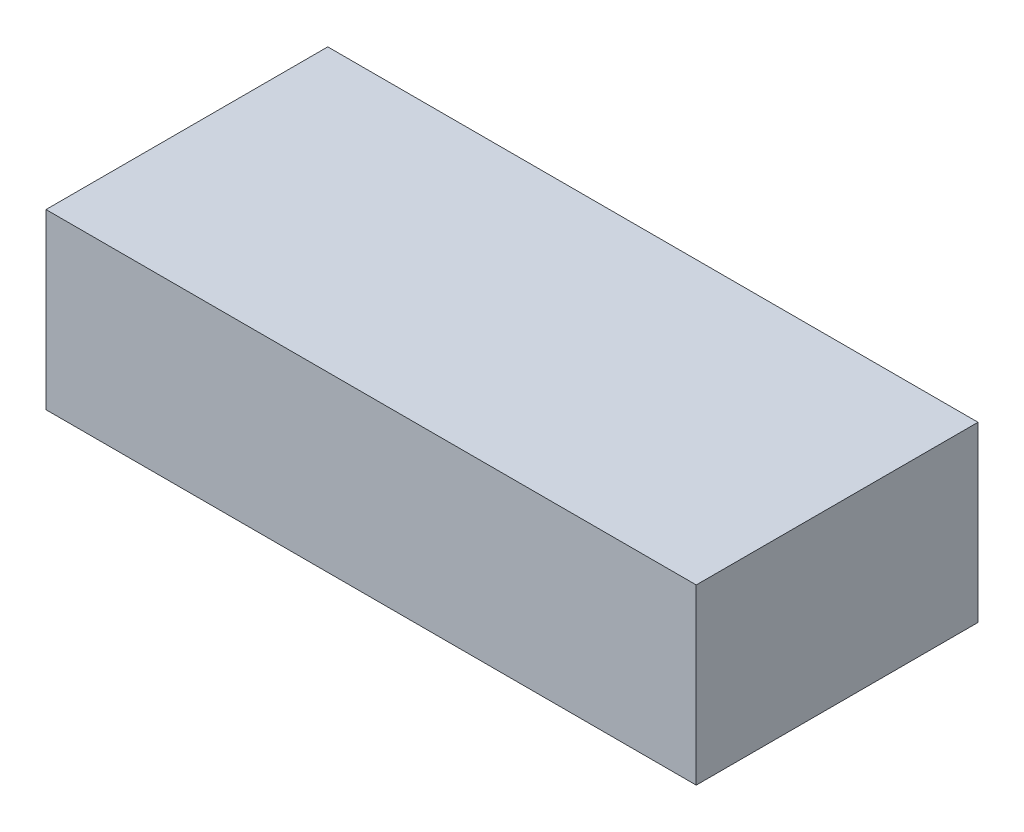
ISO-10303-21;
HEADER;
FILE_DESCRIPTION(('STEP AP214'),'2;1');
FILE_NAME('part.step','',(''),(''),'','','');
FILE_SCHEMA(('AUTOMOTIVE_DESIGN { 1 0 10303 214 1 1 1 1 }'));
ENDSEC;
DATA;
#1=APPLICATION_CONTEXT('core data for automotive mechanical design processes');
#2=APPLICATION_PROTOCOL_DEFINITION('international standard','automotive_design',2000,#1);
#3=PRODUCT_CONTEXT('',#1,'mechanical');
#4=PRODUCT('Part','Part','',(#3));
#5=PRODUCT_RELATED_PRODUCT_CATEGORY('part','',(#4));
#6=PRODUCT_DEFINITION_FORMATION('','',#4);
#7=PRODUCT_DEFINITION_CONTEXT('part definition',#1,'design');
#8=PRODUCT_DEFINITION('design','',#6,#7);
#9=PRODUCT_DEFINITION_SHAPE('','',#8);
#10=(LENGTH_UNIT() NAMED_UNIT(*) SI_UNIT(.MILLI.,.METRE.));
#11=(NAMED_UNIT(*) PLANE_ANGLE_UNIT() SI_UNIT($,.RADIAN.));
#12=(NAMED_UNIT(*) SI_UNIT($,.STERADIAN.) SOLID_ANGLE_UNIT());
#13=UNCERTAINTY_MEASURE_WITH_UNIT(LENGTH_MEASURE(1.E-05),#10,'distance_accuracy_value','');
#14=(GEOMETRIC_REPRESENTATION_CONTEXT(3) GLOBAL_UNCERTAINTY_ASSIGNED_CONTEXT((#13)) GLOBAL_UNIT_ASSIGNED_CONTEXT((#10,
#11,#12)) REPRESENTATION_CONTEXT('',''));
#15=CARTESIAN_POINT('',(0.,0.,0.));
#16=DIRECTION('',(0.,0.,1.));
#17=DIRECTION('',(1.,0.,0.));
#18=AXIS2_PLACEMENT_3D('',#15,#16,#17);
#19=CARTESIAN_POINT('',(75.,40.,32.5));
#20=DIRECTION('',(-1.,0.,0.));
#21=DIRECTION('',(0.,0.,1.));
#22=AXIS2_PLACEMENT_3D('',#19,#20,#21);
#23=PLANE('',#22);
#24=DIRECTION('',(0.,0.,-1.));
#25=VECTOR('',#24,1.);
#26=CARTESIAN_POINT('',(75.,0.,32.5));
#27=LINE('',#26,#25);
#28=CARTESIAN_POINT('',(75.,0.,32.5));
#29=VERTEX_POINT('',#28);
#30=CARTESIAN_POINT('',(75.,0.,-32.5));
#31=VERTEX_POINT('',#30);
#32=EDGE_CURVE('E164',#29,#31,#27,.T.);
#33=ORIENTED_EDGE('',*,*,#32,.T.);
#34=DIRECTION('',(0.,-1.,0.));
#35=VECTOR('',#34,1.);
#36=CARTESIAN_POINT('',(75.,40.,-32.5));
#37=LINE('',#36,#35);
#38=CARTESIAN_POINT('',(75.,40.,-32.5));
#39=VERTEX_POINT('',#38);
#40=EDGE_CURVE('E11',#39,#31,#37,.T.);
#41=ORIENTED_EDGE('',*,*,#40,.F.);
#42=DIRECTION('',(0.,0.,-1.));
#43=VECTOR('',#42,1.);
#44=CARTESIAN_POINT('',(75.,40.,32.5));
#45=LINE('',#44,#43);
#46=CARTESIAN_POINT('',(75.,40.,32.5));
#47=VERTEX_POINT('',#46);
#48=EDGE_CURVE('E170',#47,#39,#45,.T.);
#49=ORIENTED_EDGE('',*,*,#48,.F.);
#50=DIRECTION('',(0.,-1.,0.));
#51=VECTOR('',#50,1.);
#52=CARTESIAN_POINT('',(75.,40.,32.5));
#53=LINE('',#52,#51);
#54=EDGE_CURVE('E180',#47,#29,#53,.T.);
#55=ORIENTED_EDGE('',*,*,#54,.T.);
#56=EDGE_LOOP('',(#33,#41,#49,#55));
#57=FACE_BOUND('',#56,.T.);
#58=ADVANCED_FACE('F42',(#57),#23,.F.);
#59=CARTESIAN_POINT('',(-75.,40.,-32.5));
#60=DIRECTION('',(0.,0.,1.));
#61=DIRECTION('',(1.,0.,0.));
#62=AXIS2_PLACEMENT_3D('',#59,#60,#61);
#63=PLANE('',#62);
#64=CARTESIAN_POINT('',(-38.12,12.19,-32.5));
#65=DIRECTION('',(0.,0.,-1.));
#66=DIRECTION('',(-1.,0.,0.));
#67=AXIS2_PLACEMENT_3D('',#64,#65,#66);
#68=CIRCLE('',#67,4.);
#69=CARTESIAN_POINT('',(-42.12,12.19,-32.5));
#70=VERTEX_POINT('',#69);
#71=EDGE_CURVE('E232',#70,#70,#68,.T.);
#72=ORIENTED_EDGE('',*,*,#71,.F.);
#73=EDGE_LOOP('',(#72));
#74=FACE_BOUND('',#73,.T.);
#75=DIRECTION('',(-1.,0.,0.));
#76=VECTOR('',#75,1.);
#77=CARTESIAN_POINT('',(-75.,0.,-32.5));
#78=LINE('',#77,#76);
#79=CARTESIAN_POINT('',(-75.,0.,-32.5));
#80=VERTEX_POINT('',#79);
#81=EDGE_CURVE('E184',#31,#80,#78,.T.);
#82=ORIENTED_EDGE('',*,*,#81,.T.);
#83=DIRECTION('',(0.,-1.,0.));
#84=VECTOR('',#83,1.);
#85=CARTESIAN_POINT('',(-75.,40.,-32.5));
#86=LINE('',#85,#84);
#87=CARTESIAN_POINT('',(-75.,40.,-32.5));
#88=VERTEX_POINT('',#87);
#89=EDGE_CURVE('E50',#88,#80,#86,.T.);
#90=ORIENTED_EDGE('',*,*,#89,.F.);
#91=DIRECTION('',(-1.,0.,0.));
#92=VECTOR('',#91,1.);
#93=CARTESIAN_POINT('',(-75.,40.,-32.5));
#94=LINE('',#93,#92);
#95=EDGE_CURVE('E94',#39,#88,#94,.T.);
#96=ORIENTED_EDGE('',*,*,#95,.F.);
#97=ORIENTED_EDGE('',*,*,#40,.T.);
#98=EDGE_LOOP('',(#82,#90,#96,#97));
#99=FACE_BOUND('',#98,.T.);
#100=ADVANCED_FACE('F218',(#74,#99),#63,.F.);
#101=CARTESIAN_POINT('',(-75.,40.,32.5));
#102=DIRECTION('',(1.,0.,0.));
#103=DIRECTION('',(0.,0.,-1.));
#104=AXIS2_PLACEMENT_3D('',#101,#102,#103);
#105=PLANE('',#104);
#106=DIRECTION('',(0.,0.,1.));
#107=VECTOR('',#106,1.);
#108=CARTESIAN_POINT('',(-75.,0.,32.5));
#109=LINE('',#108,#107);
#110=CARTESIAN_POINT('',(-75.,0.,32.5));
#111=VERTEX_POINT('',#110);
#112=EDGE_CURVE('E187',#80,#111,#109,.T.);
#113=ORIENTED_EDGE('',*,*,#112,.T.);
#114=DIRECTION('',(0.,-1.,0.));
#115=VECTOR('',#114,1.);
#116=CARTESIAN_POINT('',(-75.,40.,32.5));
#117=LINE('',#116,#115);
#118=CARTESIAN_POINT('',(-75.,40.,32.5));
#119=VERTEX_POINT('',#118);
#120=EDGE_CURVE('E194',#119,#111,#117,.T.);
#121=ORIENTED_EDGE('',*,*,#120,.F.);
#122=DIRECTION('',(0.,0.,1.));
#123=VECTOR('',#122,1.);
#124=CARTESIAN_POINT('',(-75.,40.,32.5));
#125=LINE('',#124,#123);
#126=EDGE_CURVE('E175',#88,#119,#125,.T.);
#127=ORIENTED_EDGE('',*,*,#126,.F.);
#128=ORIENTED_EDGE('',*,*,#89,.T.);
#129=EDGE_LOOP('',(#113,#121,#127,#128));
#130=FACE_BOUND('',#129,.T.);
#131=ADVANCED_FACE('F201',(#130),#105,.F.);
#132=CARTESIAN_POINT('',(-75.,40.,32.5));
#133=DIRECTION('',(0.,0.,-1.));
#134=DIRECTION('',(-1.,0.,0.));
#135=AXIS2_PLACEMENT_3D('',#132,#133,#134);
#136=PLANE('',#135);
#137=DIRECTION('',(1.,0.,0.));
#138=VECTOR('',#137,1.);
#139=CARTESIAN_POINT('',(-75.,0.,32.5));
#140=LINE('',#139,#138);
#141=EDGE_CURVE('E87',#111,#29,#140,.T.);
#142=ORIENTED_EDGE('',*,*,#141,.T.);
#143=ORIENTED_EDGE('',*,*,#54,.F.);
#144=DIRECTION('',(1.,0.,0.));
#145=VECTOR('',#144,1.);
#146=CARTESIAN_POINT('',(-75.,40.,32.5));
#147=LINE('',#146,#145);
#148=EDGE_CURVE('E66',#119,#47,#147,.T.);
#149=ORIENTED_EDGE('',*,*,#148,.F.);
#150=ORIENTED_EDGE('',*,*,#120,.T.);
#151=EDGE_LOOP('',(#142,#143,#149,#150));
#152=FACE_BOUND('',#151,.T.);
#153=ADVANCED_FACE('F209',(#152),#136,.F.);
#154=CARTESIAN_POINT('',(0.,40.,0.));
#155=DIRECTION('',(0.,-1.,0.));
#156=DIRECTION('',(0.,0.,-1.));
#157=AXIS2_PLACEMENT_3D('',#154,#155,#156);
#158=PLANE('',#157);
#159=ORIENTED_EDGE('',*,*,#48,.T.);
#160=ORIENTED_EDGE('',*,*,#95,.T.);
#161=ORIENTED_EDGE('',*,*,#126,.T.);
#162=ORIENTED_EDGE('',*,*,#148,.T.);
#163=EDGE_LOOP('',(#159,#160,#161,#162));
#164=FACE_BOUND('',#163,.T.);
#165=ADVANCED_FACE('F211',(#164),#158,.F.);
#166=CARTESIAN_POINT('',(0.,0.,0.));
#167=DIRECTION('',(0.,-1.,0.));
#168=DIRECTION('',(0.,0.,-1.));
#169=AXIS2_PLACEMENT_3D('',#166,#167,#168);
#170=PLANE('',#169);
#171=DIRECTION('',(0.,0.,1.));
#172=VECTOR('',#171,1.);
#173=CARTESIAN_POINT('',(71.952,0.,-29.452));
#174=LINE('',#173,#172);
#175=CARTESIAN_POINT('',(71.952,0.,-29.452));
#176=VERTEX_POINT('',#175);
#177=CARTESIAN_POINT('',(71.952,0.,29.452));
#178=VERTEX_POINT('',#177);
#179=EDGE_CURVE('E57',#176,#178,#174,.T.);
#180=ORIENTED_EDGE('',*,*,#179,.F.);
#181=DIRECTION('',(1.,0.,0.));
#182=VECTOR('',#181,1.);
#183=CARTESIAN_POINT('',(-71.952,0.,-29.452));
#184=LINE('',#183,#182);
#185=CARTESIAN_POINT('',(-71.952,0.,-29.452));
#186=VERTEX_POINT('',#185);
#187=EDGE_CURVE('E139',#186,#176,#184,.T.);
#188=ORIENTED_EDGE('',*,*,#187,.F.);
#189=DIRECTION('',(0.,0.,-1.));
#190=VECTOR('',#189,1.);
#191=CARTESIAN_POINT('',(-71.952,0.,-29.452));
#192=LINE('',#191,#190);
#193=CARTESIAN_POINT('',(-71.952,0.,29.452));
#194=VERTEX_POINT('',#193);
#195=EDGE_CURVE('E143',#194,#186,#192,.T.);
#196=ORIENTED_EDGE('',*,*,#195,.F.);
#197=DIRECTION('',(-1.,0.,0.));
#198=VECTOR('',#197,1.);
#199=CARTESIAN_POINT('',(-71.952,0.,29.452));
#200=LINE('',#199,#198);
#201=EDGE_CURVE('E155',#178,#194,#200,.T.);
#202=ORIENTED_EDGE('',*,*,#201,.F.);
#203=EDGE_LOOP('',(#180,#188,#196,#202));
#204=FACE_BOUND('',#203,.T.);
#205=ORIENTED_EDGE('',*,*,#32,.F.);
#206=ORIENTED_EDGE('',*,*,#141,.F.);
#207=ORIENTED_EDGE('',*,*,#112,.F.);
#208=ORIENTED_EDGE('',*,*,#81,.F.);
#209=EDGE_LOOP('',(#205,#206,#207,#208));
#210=FACE_BOUND('',#209,.T.);
#211=ADVANCED_FACE('F205',(#204,#210),#170,.T.);
#212=CARTESIAN_POINT('',(71.952,28.4,-29.452));
#213=DIRECTION('',(1.,0.,0.));
#214=DIRECTION('',(0.,0.,-1.));
#215=AXIS2_PLACEMENT_3D('',#212,#213,#214);
#216=PLANE('',#215);
#217=ORIENTED_EDGE('',*,*,#179,.T.);
#218=DIRECTION('',(0.,-1.,0.));
#219=VECTOR('',#218,1.);
#220=CARTESIAN_POINT('',(71.952,28.4,29.452));
#221=LINE('',#220,#219);
#222=CARTESIAN_POINT('',(71.952,28.4,29.452));
#223=VERTEX_POINT('',#222);
#224=EDGE_CURVE('E114',#223,#178,#221,.T.);
#225=ORIENTED_EDGE('',*,*,#224,.F.);
#226=DIRECTION('',(0.,0.,1.));
#227=VECTOR('',#226,1.);
#228=CARTESIAN_POINT('',(71.952,28.4,-29.452));
#229=LINE('',#228,#227);
#230=CARTESIAN_POINT('',(71.952,28.4,-29.452));
#231=VERTEX_POINT('',#230);
#232=EDGE_CURVE('E118',#231,#223,#229,.T.);
#233=ORIENTED_EDGE('',*,*,#232,.F.);
#234=DIRECTION('',(0.,-1.,0.));
#235=VECTOR('',#234,1.);
#236=CARTESIAN_POINT('',(71.952,28.4,-29.452));
#237=LINE('',#236,#235);
#238=EDGE_CURVE('E161',#231,#176,#237,.T.);
#239=ORIENTED_EDGE('',*,*,#238,.T.);
#240=EDGE_LOOP('',(#217,#225,#233,#239));
#241=FACE_BOUND('',#240,.T.);
#242=ADVANCED_FACE('F116',(#241),#216,.F.);
#243=CARTESIAN_POINT('',(-71.952,28.4,-29.452));
#244=DIRECTION('',(0.,0.,-1.));
#245=DIRECTION('',(-1.,0.,0.));
#246=AXIS2_PLACEMENT_3D('',#243,#244,#245);
#247=PLANE('',#246);
#248=CARTESIAN_POINT('',(-38.12,12.19,-29.452));
#249=DIRECTION('',(0.,0.,-1.));
#250=DIRECTION('',(-1.,0.,0.));
#251=AXIS2_PLACEMENT_3D('',#248,#249,#250);
#252=CIRCLE('',#251,4.);
#253=CARTESIAN_POINT('',(-42.12,12.19,-29.452));
#254=VERTEX_POINT('',#253);
#255=EDGE_CURVE('E146',#254,#254,#252,.F.);
#256=ORIENTED_EDGE('',*,*,#255,.F.);
#257=EDGE_LOOP('',(#256));
#258=FACE_BOUND('',#257,.T.);
#259=ORIENTED_EDGE('',*,*,#187,.T.);
#260=ORIENTED_EDGE('',*,*,#238,.F.);
#261=DIRECTION('',(1.,0.,0.));
#262=VECTOR('',#261,1.);
#263=CARTESIAN_POINT('',(-71.952,28.4,-29.452));
#264=LINE('',#263,#262);
#265=CARTESIAN_POINT('',(-71.952,28.4,-29.452));
#266=VERTEX_POINT('',#265);
#267=EDGE_CURVE('E125',#266,#231,#264,.T.);
#268=ORIENTED_EDGE('',*,*,#267,.F.);
#269=DIRECTION('',(0.,-1.,0.));
#270=VECTOR('',#269,1.);
#271=CARTESIAN_POINT('',(-71.952,28.4,-29.452));
#272=LINE('',#271,#270);
#273=EDGE_CURVE('E165',#266,#186,#272,.T.);
#274=ORIENTED_EDGE('',*,*,#273,.T.);
#275=EDGE_LOOP('',(#259,#260,#268,#274));
#276=FACE_BOUND('',#275,.T.);
#277=ADVANCED_FACE('F241',(#258,#276),#247,.F.);
#278=CARTESIAN_POINT('',(-71.952,28.4,-29.452));
#279=DIRECTION('',(-1.,0.,0.));
#280=DIRECTION('',(0.,0.,1.));
#281=AXIS2_PLACEMENT_3D('',#278,#279,#280);
#282=PLANE('',#281);
#283=ORIENTED_EDGE('',*,*,#195,.T.);
#284=ORIENTED_EDGE('',*,*,#273,.F.);
#285=DIRECTION('',(0.,0.,-1.));
#286=VECTOR('',#285,1.);
#287=CARTESIAN_POINT('',(-71.952,28.4,-29.452));
#288=LINE('',#287,#286);
#289=CARTESIAN_POINT('',(-71.952,28.4,29.452));
#290=VERTEX_POINT('',#289);
#291=EDGE_CURVE('E134',#290,#266,#288,.T.);
#292=ORIENTED_EDGE('',*,*,#291,.F.);
#293=DIRECTION('',(0.,-1.,0.));
#294=VECTOR('',#293,1.);
#295=CARTESIAN_POINT('',(-71.952,28.4,29.452));
#296=LINE('',#295,#294);
#297=EDGE_CURVE('E124',#290,#194,#296,.T.);
#298=ORIENTED_EDGE('',*,*,#297,.T.);
#299=EDGE_LOOP('',(#283,#284,#292,#298));
#300=FACE_BOUND('',#299,.T.);
#301=ADVANCED_FACE('F243',(#300),#282,.F.);
#302=CARTESIAN_POINT('',(-71.952,28.4,29.452));
#303=DIRECTION('',(0.,0.,1.));
#304=DIRECTION('',(1.,0.,0.));
#305=AXIS2_PLACEMENT_3D('',#302,#303,#304);
#306=PLANE('',#305);
#307=ORIENTED_EDGE('',*,*,#201,.T.);
#308=ORIENTED_EDGE('',*,*,#297,.F.);
#309=DIRECTION('',(-1.,0.,0.));
#310=VECTOR('',#309,1.);
#311=CARTESIAN_POINT('',(-71.952,28.4,29.452));
#312=LINE('',#311,#310);
#313=EDGE_CURVE('E128',#223,#290,#312,.T.);
#314=ORIENTED_EDGE('',*,*,#313,.F.);
#315=ORIENTED_EDGE('',*,*,#224,.T.);
#316=EDGE_LOOP('',(#307,#308,#314,#315));
#317=FACE_BOUND('',#316,.T.);
#318=ADVANCED_FACE('F129',(#317),#306,.F.);
#319=CARTESIAN_POINT('',(0.,28.4,0.));
#320=DIRECTION('',(0.,1.,0.));
#321=DIRECTION('',(0.,0.,1.));
#322=AXIS2_PLACEMENT_3D('',#319,#320,#321);
#323=PLANE('',#322);
#324=ORIENTED_EDGE('',*,*,#232,.T.);
#325=ORIENTED_EDGE('',*,*,#313,.T.);
#326=ORIENTED_EDGE('',*,*,#291,.T.);
#327=ORIENTED_EDGE('',*,*,#267,.T.);
#328=EDGE_LOOP('',(#324,#325,#326,#327));
#329=FACE_BOUND('',#328,.T.);
#330=ADVANCED_FACE('F136',(#329),#323,.F.);
#331=CARTESIAN_POINT('',(-38.12,12.19,-18.1382915010152));
#332=DIRECTION('',(0.,0.,-1.));
#333=DIRECTION('',(-1.,0.,0.));
#334=AXIS2_PLACEMENT_3D('',#331,#332,#333);
#335=CYLINDRICAL_SURFACE('',#334,4.);
#336=ORIENTED_EDGE('',*,*,#255,.T.);
#337=EDGE_LOOP('',(#336));
#338=FACE_BOUND('',#337,.T.);
#339=ORIENTED_EDGE('',*,*,#71,.T.);
#340=EDGE_LOOP('',(#339));
#341=FACE_BOUND('',#340,.T.);
#342=ADVANCED_FACE('F239',(#338,#341),#335,.F.);
#343=CLOSED_SHELL('',(#58,#100,#131,#153,#165,#211,#242,#277,#301,#318,#330,#342));
#344=MANIFOLD_SOLID_BREP('B2',#343);
#345=ADVANCED_BREP_SHAPE_REPRESENTATION('',(#18,#344),#14);
#346=SHAPE_DEFINITION_REPRESENTATION(#9,#345);
ENDSEC;
END-ISO-10303-21;
